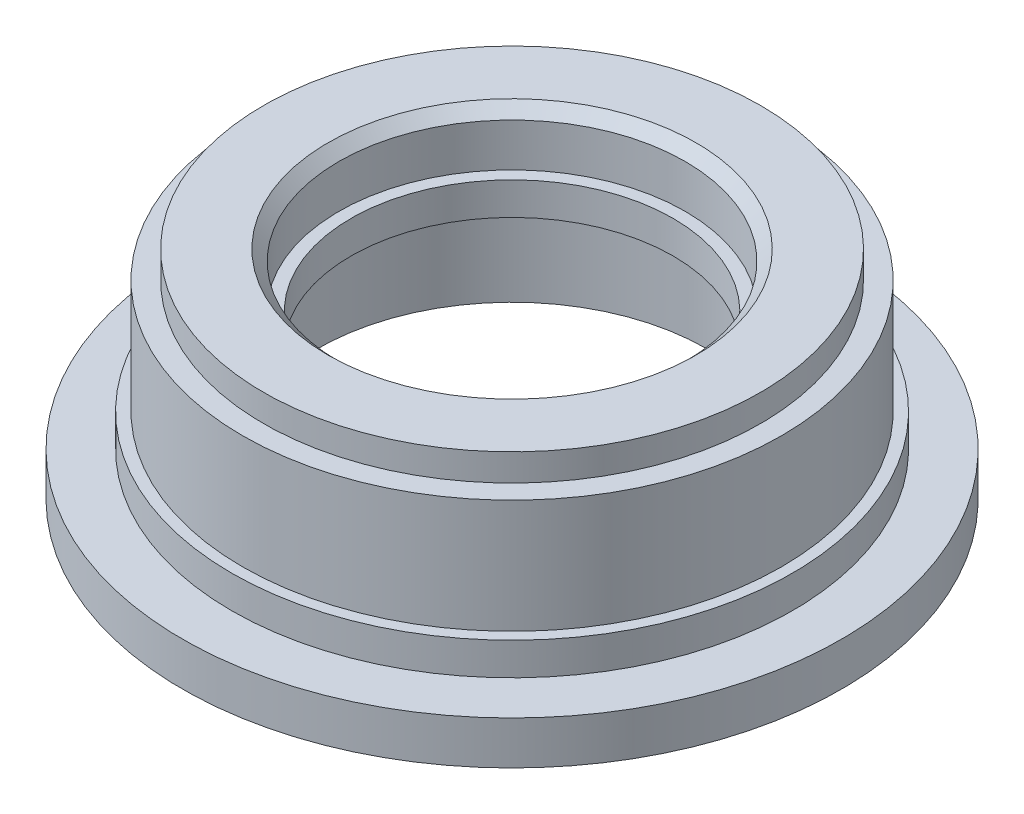
ISO-10303-21;
HEADER;
FILE_DESCRIPTION(('STEP AP214'),'2;1');
FILE_NAME('part.step','',(''),(''),'','','');
FILE_SCHEMA(('AUTOMOTIVE_DESIGN { 1 0 10303 214 1 1 1 1 }'));
ENDSEC;
DATA;
#1=APPLICATION_CONTEXT('core data for automotive mechanical design processes');
#2=APPLICATION_PROTOCOL_DEFINITION('international standard','automotive_design',2000,#1);
#3=PRODUCT_CONTEXT('',#1,'mechanical');
#4=PRODUCT('Part','Part','',(#3));
#5=PRODUCT_RELATED_PRODUCT_CATEGORY('part','',(#4));
#6=PRODUCT_DEFINITION_FORMATION('','',#4);
#7=PRODUCT_DEFINITION_CONTEXT('part definition',#1,'design');
#8=PRODUCT_DEFINITION('design','',#6,#7);
#9=PRODUCT_DEFINITION_SHAPE('','',#8);
#10=(LENGTH_UNIT() NAMED_UNIT(*) SI_UNIT(.MILLI.,.METRE.));
#11=(NAMED_UNIT(*) PLANE_ANGLE_UNIT() SI_UNIT($,.RADIAN.));
#12=(NAMED_UNIT(*) SI_UNIT($,.STERADIAN.) SOLID_ANGLE_UNIT());
#13=UNCERTAINTY_MEASURE_WITH_UNIT(LENGTH_MEASURE(1.E-05),#10,'distance_accuracy_value','');
#14=(GEOMETRIC_REPRESENTATION_CONTEXT(3) GLOBAL_UNCERTAINTY_ASSIGNED_CONTEXT((#13)) GLOBAL_UNIT_ASSIGNED_CONTEXT((#10,
#11,#12)) REPRESENTATION_CONTEXT('',''));
#15=CARTESIAN_POINT('',(0.,0.,0.));
#16=DIRECTION('',(0.,0.,1.));
#17=DIRECTION('',(1.,0.,0.));
#18=AXIS2_PLACEMENT_3D('',#15,#16,#17);
#19=CARTESIAN_POINT('',(0.,16.6624,0.));
#20=DIRECTION('',(0.,1.,0.));
#21=DIRECTION('',(0.,0.,1.));
#22=AXIS2_PLACEMENT_3D('',#19,#20,#21);
#23=CONICAL_SURFACE('',#22,13.49375,0.785398163397448);
#24=CARTESIAN_POINT('',(0.,15.86865,0.));
#25=DIRECTION('',(0.,-1.,0.));
#26=DIRECTION('',(0.,0.,-1.));
#27=AXIS2_PLACEMENT_3D('',#24,#25,#26);
#28=CIRCLE('',#27,12.7);
#29=CARTESIAN_POINT('',(0.,15.86865,-12.7));
#30=VERTEX_POINT('',#29);
#31=EDGE_CURVE('E30',#30,#30,#28,.T.);
#32=ORIENTED_EDGE('',*,*,#31,.T.);
#33=EDGE_LOOP('',(#32));
#34=FACE_BOUND('',#33,.T.);
#35=CARTESIAN_POINT('',(0.,16.6624,0.));
#36=DIRECTION('',(0.,1.,0.));
#37=DIRECTION('',(0.,0.,1.));
#38=AXIS2_PLACEMENT_3D('',#35,#36,#37);
#39=CIRCLE('',#38,13.49375);
#40=CARTESIAN_POINT('',(0.,16.6624,13.49375));
#41=VERTEX_POINT('',#40);
#42=EDGE_CURVE('E18',#41,#41,#39,.F.);
#43=ORIENTED_EDGE('',*,*,#42,.F.);
#44=EDGE_LOOP('',(#43));
#45=FACE_BOUND('',#44,.T.);
#46=ADVANCED_FACE('F15',(#34,#45),#23,.F.);
#47=CARTESIAN_POINT('',(0.,0.,0.));
#48=DIRECTION('',(0.,-1.,0.));
#49=DIRECTION('',(0.,0.,-1.));
#50=AXIS2_PLACEMENT_3D('',#47,#48,#49);
#51=CYLINDRICAL_SURFACE('',#50,12.7);
#52=CARTESIAN_POINT('',(0.,12.7,0.));
#53=DIRECTION('',(0.,-1.,0.));
#54=DIRECTION('',(0.,0.,-1.));
#55=AXIS2_PLACEMENT_3D('',#52,#53,#54);
#56=CIRCLE('',#55,12.7);
#57=CARTESIAN_POINT('',(0.,12.7,-12.7));
#58=VERTEX_POINT('',#57);
#59=EDGE_CURVE('E72',#58,#58,#56,.F.);
#60=ORIENTED_EDGE('',*,*,#59,.F.);
#61=EDGE_LOOP('',(#60));
#62=FACE_BOUND('',#61,.T.);
#63=ORIENTED_EDGE('',*,*,#31,.F.);
#64=EDGE_LOOP('',(#63));
#65=FACE_BOUND('',#64,.T.);
#66=ADVANCED_FACE('F84',(#62,#65),#51,.F.);
#67=CARTESIAN_POINT('',(13.49375,16.6624,0.));
#68=DIRECTION('',(0.,1.,0.));
#69=DIRECTION('',(0.,0.,1.));
#70=AXIS2_PLACEMENT_3D('',#67,#68,#69);
#71=PLANE('',#70);
#72=CARTESIAN_POINT('',(0.,16.6624,0.));
#73=DIRECTION('',(0.,-1.,0.));
#74=DIRECTION('',(0.,0.,-1.));
#75=AXIS2_PLACEMENT_3D('',#72,#73,#74);
#76=CIRCLE('',#75,18.2245);
#77=CARTESIAN_POINT('',(0.,16.6624,-18.2245));
#78=VERTEX_POINT('',#77);
#79=EDGE_CURVE('E70',#78,#78,#76,.T.);
#80=ORIENTED_EDGE('',*,*,#79,.F.);
#81=EDGE_LOOP('',(#80));
#82=FACE_BOUND('',#81,.T.);
#83=ORIENTED_EDGE('',*,*,#42,.T.);
#84=EDGE_LOOP('',(#83));
#85=FACE_BOUND('',#84,.T.);
#86=ADVANCED_FACE('F86',(#82,#85),#71,.T.);
#87=CARTESIAN_POINT('',(11.811,12.7,0.));
#88=DIRECTION('',(0.,1.,0.));
#89=DIRECTION('',(0.,0.,1.));
#90=AXIS2_PLACEMENT_3D('',#87,#88,#89);
#91=PLANE('',#90);
#92=ORIENTED_EDGE('',*,*,#59,.T.);
#93=EDGE_LOOP('',(#92));
#94=FACE_BOUND('',#93,.T.);
#95=CARTESIAN_POINT('',(0.,12.7,0.));
#96=DIRECTION('',(0.,-1.,0.));
#97=DIRECTION('',(0.,0.,-1.));
#98=AXIS2_PLACEMENT_3D('',#95,#96,#97);
#99=CIRCLE('',#98,11.811);
#100=CARTESIAN_POINT('',(0.,12.7,-11.811));
#101=VERTEX_POINT('',#100);
#102=EDGE_CURVE('E67',#101,#101,#99,.T.);
#103=ORIENTED_EDGE('',*,*,#102,.T.);
#104=EDGE_LOOP('',(#103));
#105=FACE_BOUND('',#104,.T.);
#106=ADVANCED_FACE('F93',(#94,#105),#91,.T.);
#107=CARTESIAN_POINT('',(0.,0.,0.));
#108=DIRECTION('',(0.,-1.,0.));
#109=DIRECTION('',(0.,0.,-1.));
#110=AXIS2_PLACEMENT_3D('',#107,#108,#109);
#111=CYLINDRICAL_SURFACE('',#110,18.2245);
#112=ORIENTED_EDGE('',*,*,#79,.T.);
#113=EDGE_LOOP('',(#112));
#114=FACE_BOUND('',#113,.T.);
#115=CARTESIAN_POINT('',(0.,14.678025,0.));
#116=DIRECTION('',(0.,-1.,0.));
#117=DIRECTION('',(0.,0.,-1.));
#118=AXIS2_PLACEMENT_3D('',#115,#116,#117);
#119=CIRCLE('',#118,18.2245);
#120=CARTESIAN_POINT('',(0.,14.678025,-18.2245));
#121=VERTEX_POINT('',#120);
#122=EDGE_CURVE('E64',#121,#121,#119,.T.);
#123=ORIENTED_EDGE('',*,*,#122,.F.);
#124=EDGE_LOOP('',(#123));
#125=FACE_BOUND('',#124,.T.);
#126=ADVANCED_FACE('F154',(#114,#125),#111,.T.);
#127=CARTESIAN_POINT('',(0.,0.,0.));
#128=DIRECTION('',(0.,-1.,0.));
#129=DIRECTION('',(0.,0.,-1.));
#130=AXIS2_PLACEMENT_3D('',#127,#128,#129);
#131=CYLINDRICAL_SURFACE('',#130,11.811);
#132=CARTESIAN_POINT('',(0.,10.3124,0.));
#133=DIRECTION('',(0.,-1.,0.));
#134=DIRECTION('',(0.,0.,-1.));
#135=AXIS2_PLACEMENT_3D('',#132,#133,#134);
#136=CIRCLE('',#135,11.811);
#137=CARTESIAN_POINT('',(0.,10.3124,-11.811));
#138=VERTEX_POINT('',#137);
#139=EDGE_CURVE('E61',#138,#138,#136,.F.);
#140=ORIENTED_EDGE('',*,*,#139,.F.);
#141=EDGE_LOOP('',(#140));
#142=FACE_BOUND('',#141,.T.);
#143=ORIENTED_EDGE('',*,*,#102,.F.);
#144=EDGE_LOOP('',(#143));
#145=FACE_BOUND('',#144,.T.);
#146=ADVANCED_FACE('F150',(#142,#145),#131,.F.);
#147=CARTESIAN_POINT('',(18.2245,14.678025,0.));
#148=DIRECTION('',(0.,1.,0.));
#149=DIRECTION('',(0.,0.,1.));
#150=AXIS2_PLACEMENT_3D('',#147,#148,#149);
#151=PLANE('',#150);
#152=CARTESIAN_POINT('',(0.,14.678025,0.));
#153=DIRECTION('',(0.,-1.,0.));
#154=DIRECTION('',(0.,0.,-1.));
#155=AXIS2_PLACEMENT_3D('',#152,#153,#154);
#156=CIRCLE('',#155,19.7612);
#157=CARTESIAN_POINT('',(0.,14.678025,-19.7612));
#158=VERTEX_POINT('',#157);
#159=EDGE_CURVE('E58',#158,#158,#156,.T.);
#160=ORIENTED_EDGE('',*,*,#159,.F.);
#161=EDGE_LOOP('',(#160));
#162=FACE_BOUND('',#161,.T.);
#163=ORIENTED_EDGE('',*,*,#122,.T.);
#164=EDGE_LOOP('',(#163));
#165=FACE_BOUND('',#164,.T.);
#166=ADVANCED_FACE('F146',(#162,#165),#151,.T.);
#167=CARTESIAN_POINT('',(14.2875,10.3124,0.));
#168=DIRECTION('',(0.,-1.,0.));
#169=DIRECTION('',(0.,0.,-1.));
#170=AXIS2_PLACEMENT_3D('',#167,#168,#169);
#171=PLANE('',#170);
#172=ORIENTED_EDGE('',*,*,#139,.T.);
#173=EDGE_LOOP('',(#172));
#174=FACE_BOUND('',#173,.T.);
#175=CARTESIAN_POINT('',(0.,10.3124,0.));
#176=DIRECTION('',(0.,-1.,0.));
#177=DIRECTION('',(0.,0.,-1.));
#178=AXIS2_PLACEMENT_3D('',#175,#176,#177);
#179=CIRCLE('',#178,14.2875);
#180=CARTESIAN_POINT('',(0.,10.3124,-14.2875));
#181=VERTEX_POINT('',#180);
#182=EDGE_CURVE('E55',#181,#181,#179,.T.);
#183=ORIENTED_EDGE('',*,*,#182,.T.);
#184=EDGE_LOOP('',(#183));
#185=FACE_BOUND('',#184,.T.);
#186=ADVANCED_FACE('F142',(#174,#185),#171,.T.);
#187=CARTESIAN_POINT('',(0.,0.,0.));
#188=DIRECTION('',(0.,-1.,0.));
#189=DIRECTION('',(0.,0.,-1.));
#190=AXIS2_PLACEMENT_3D('',#187,#188,#189);
#191=CYLINDRICAL_SURFACE('',#190,19.7612);
#192=ORIENTED_EDGE('',*,*,#159,.T.);
#193=EDGE_LOOP('',(#192));
#194=FACE_BOUND('',#193,.T.);
#195=CARTESIAN_POINT('',(0.,6.35,0.));
#196=DIRECTION('',(0.,-1.,0.));
#197=DIRECTION('',(0.,0.,-1.));
#198=AXIS2_PLACEMENT_3D('',#195,#196,#197);
#199=CIRCLE('',#198,19.7612);
#200=CARTESIAN_POINT('',(0.,6.35,-19.7612));
#201=VERTEX_POINT('',#200);
#202=EDGE_CURVE('E52',#201,#201,#199,.T.);
#203=ORIENTED_EDGE('',*,*,#202,.F.);
#204=EDGE_LOOP('',(#203));
#205=FACE_BOUND('',#204,.T.);
#206=ADVANCED_FACE('F138',(#194,#205),#191,.T.);
#207=CARTESIAN_POINT('',(0.,0.,0.));
#208=DIRECTION('',(0.,-1.,0.));
#209=DIRECTION('',(0.,0.,-1.));
#210=AXIS2_PLACEMENT_3D('',#207,#208,#209);
#211=CYLINDRICAL_SURFACE('',#210,14.2875);
#212=CARTESIAN_POINT('',(0.,3.175,0.));
#213=DIRECTION('',(0.,-1.,0.));
#214=DIRECTION('',(0.,0.,-1.));
#215=AXIS2_PLACEMENT_3D('',#212,#213,#214);
#216=CIRCLE('',#215,14.2875);
#217=CARTESIAN_POINT('',(0.,3.175,-14.2875));
#218=VERTEX_POINT('',#217);
#219=EDGE_CURVE('E49',#218,#218,#216,.F.);
#220=ORIENTED_EDGE('',*,*,#219,.F.);
#221=EDGE_LOOP('',(#220));
#222=FACE_BOUND('',#221,.T.);
#223=ORIENTED_EDGE('',*,*,#182,.F.);
#224=EDGE_LOOP('',(#223));
#225=FACE_BOUND('',#224,.T.);
#226=ADVANCED_FACE('F134',(#222,#225),#211,.F.);
#227=CARTESIAN_POINT('',(19.7612,6.35,0.));
#228=DIRECTION('',(0.,1.,0.));
#229=DIRECTION('',(0.,0.,1.));
#230=AXIS2_PLACEMENT_3D('',#227,#228,#229);
#231=PLANE('',#230);
#232=CARTESIAN_POINT('',(0.,6.35,0.));
#233=DIRECTION('',(0.,-1.,0.));
#234=DIRECTION('',(0.,0.,-1.));
#235=AXIS2_PLACEMENT_3D('',#232,#233,#234);
#236=CIRCLE('',#235,20.5613);
#237=CARTESIAN_POINT('',(0.,6.35,-20.5613));
#238=VERTEX_POINT('',#237);
#239=EDGE_CURVE('E46',#238,#238,#236,.T.);
#240=ORIENTED_EDGE('',*,*,#239,.F.);
#241=EDGE_LOOP('',(#240));
#242=FACE_BOUND('',#241,.T.);
#243=ORIENTED_EDGE('',*,*,#202,.T.);
#244=EDGE_LOOP('',(#243));
#245=FACE_BOUND('',#244,.T.);
#246=ADVANCED_FACE('F130',(#242,#245),#231,.T.);
#247=CARTESIAN_POINT('',(17.0561,3.175,0.));
#248=DIRECTION('',(0.,-1.,0.));
#249=DIRECTION('',(0.,0.,-1.));
#250=AXIS2_PLACEMENT_3D('',#247,#248,#249);
#251=PLANE('',#250);
#252=ORIENTED_EDGE('',*,*,#219,.T.);
#253=EDGE_LOOP('',(#252));
#254=FACE_BOUND('',#253,.T.);
#255=CARTESIAN_POINT('',(0.,3.175,0.));
#256=DIRECTION('',(0.,-1.,0.));
#257=DIRECTION('',(0.,0.,-1.));
#258=AXIS2_PLACEMENT_3D('',#255,#256,#257);
#259=CIRCLE('',#258,17.0561);
#260=CARTESIAN_POINT('',(0.,3.175,-17.0561));
#261=VERTEX_POINT('',#260);
#262=EDGE_CURVE('E43',#261,#261,#259,.T.);
#263=ORIENTED_EDGE('',*,*,#262,.T.);
#264=EDGE_LOOP('',(#263));
#265=FACE_BOUND('',#264,.T.);
#266=ADVANCED_FACE('F126',(#254,#265),#251,.T.);
#267=CARTESIAN_POINT('',(0.,0.,0.));
#268=DIRECTION('',(0.,-1.,0.));
#269=DIRECTION('',(0.,0.,-1.));
#270=AXIS2_PLACEMENT_3D('',#267,#268,#269);
#271=CYLINDRICAL_SURFACE('',#270,20.5613);
#272=ORIENTED_EDGE('',*,*,#239,.T.);
#273=EDGE_LOOP('',(#272));
#274=FACE_BOUND('',#273,.T.);
#275=CARTESIAN_POINT('',(0.,3.9624,0.));
#276=DIRECTION('',(0.,-1.,0.));
#277=DIRECTION('',(0.,0.,-1.));
#278=AXIS2_PLACEMENT_3D('',#275,#276,#277);
#279=CIRCLE('',#278,20.5613);
#280=CARTESIAN_POINT('',(0.,3.9624,-20.5613));
#281=VERTEX_POINT('',#280);
#282=EDGE_CURVE('E40',#281,#281,#279,.T.);
#283=ORIENTED_EDGE('',*,*,#282,.F.);
#284=EDGE_LOOP('',(#283));
#285=FACE_BOUND('',#284,.T.);
#286=ADVANCED_FACE('F122',(#274,#285),#271,.T.);
#287=CARTESIAN_POINT('',(0.,0.,0.));
#288=DIRECTION('',(0.,-1.,0.));
#289=DIRECTION('',(0.,0.,-1.));
#290=AXIS2_PLACEMENT_3D('',#287,#288,#289);
#291=CYLINDRICAL_SURFACE('',#290,17.0561);
#292=CARTESIAN_POINT('',(0.,1.2954,0.));
#293=DIRECTION('',(0.,-1.,0.));
#294=DIRECTION('',(0.,0.,-1.));
#295=AXIS2_PLACEMENT_3D('',#292,#293,#294);
#296=CIRCLE('',#295,17.0561);
#297=CARTESIAN_POINT('',(0.,1.2954,-17.0561));
#298=VERTEX_POINT('',#297);
#299=EDGE_CURVE('E37',#298,#298,#296,.F.);
#300=ORIENTED_EDGE('',*,*,#299,.F.);
#301=EDGE_LOOP('',(#300));
#302=FACE_BOUND('',#301,.T.);
#303=ORIENTED_EDGE('',*,*,#262,.F.);
#304=EDGE_LOOP('',(#303));
#305=FACE_BOUND('',#304,.T.);
#306=ADVANCED_FACE('F118',(#302,#305),#291,.F.);
#307=CARTESIAN_POINT('',(20.5613,3.9624,0.));
#308=DIRECTION('',(0.,1.,0.));
#309=DIRECTION('',(0.,0.,1.));
#310=AXIS2_PLACEMENT_3D('',#307,#308,#309);
#311=PLANE('',#310);
#312=CARTESIAN_POINT('',(0.,3.9624,0.));
#313=DIRECTION('',(0.,-1.,0.));
#314=DIRECTION('',(0.,0.,-1.));
#315=AXIS2_PLACEMENT_3D('',#312,#313,#314);
#316=CIRCLE('',#315,24.1681);
#317=CARTESIAN_POINT('',(0.,3.9624,-24.1681));
#318=VERTEX_POINT('',#317);
#319=EDGE_CURVE('E34',#318,#318,#316,.T.);
#320=ORIENTED_EDGE('',*,*,#319,.F.);
#321=EDGE_LOOP('',(#320));
#322=FACE_BOUND('',#321,.T.);
#323=ORIENTED_EDGE('',*,*,#282,.T.);
#324=EDGE_LOOP('',(#323));
#325=FACE_BOUND('',#324,.T.);
#326=ADVANCED_FACE('F114',(#322,#325),#311,.T.);
#327=CARTESIAN_POINT('',(18.542,1.2954,0.));
#328=DIRECTION('',(0.,-1.,0.));
#329=DIRECTION('',(0.,0.,-1.));
#330=AXIS2_PLACEMENT_3D('',#327,#328,#329);
#331=PLANE('',#330);
#332=ORIENTED_EDGE('',*,*,#299,.T.);
#333=EDGE_LOOP('',(#332));
#334=FACE_BOUND('',#333,.T.);
#335=CARTESIAN_POINT('',(0.,1.2954,0.));
#336=DIRECTION('',(0.,-1.,0.));
#337=DIRECTION('',(0.,0.,-1.));
#338=AXIS2_PLACEMENT_3D('',#335,#336,#337);
#339=CIRCLE('',#338,18.542);
#340=CARTESIAN_POINT('',(0.,1.2954,-18.542));
#341=VERTEX_POINT('',#340);
#342=EDGE_CURVE('E27',#341,#341,#339,.T.);
#343=ORIENTED_EDGE('',*,*,#342,.T.);
#344=EDGE_LOOP('',(#343));
#345=FACE_BOUND('',#344,.T.);
#346=ADVANCED_FACE('F110',(#334,#345),#331,.T.);
#347=CARTESIAN_POINT('',(0.,0.,0.));
#348=DIRECTION('',(0.,-1.,0.));
#349=DIRECTION('',(0.,0.,-1.));
#350=AXIS2_PLACEMENT_3D('',#347,#348,#349);
#351=CYLINDRICAL_SURFACE('',#350,24.1681);
#352=ORIENTED_EDGE('',*,*,#319,.T.);
#353=EDGE_LOOP('',(#352));
#354=FACE_BOUND('',#353,.T.);
#355=CARTESIAN_POINT('',(0.,0.787399999999997,0.));
#356=DIRECTION('',(0.,-1.,0.));
#357=DIRECTION('',(0.,0.,-1.));
#358=AXIS2_PLACEMENT_3D('',#355,#356,#357);
#359=CIRCLE('',#358,24.1681);
#360=CARTESIAN_POINT('',(0.,0.787399999999997,-24.1681));
#361=VERTEX_POINT('',#360);
#362=EDGE_CURVE('E22',#361,#361,#359,.T.);
#363=ORIENTED_EDGE('',*,*,#362,.F.);
#364=EDGE_LOOP('',(#363));
#365=FACE_BOUND('',#364,.T.);
#366=ADVANCED_FACE('F103',(#354,#365),#351,.T.);
#367=CARTESIAN_POINT('',(0.,0.,0.));
#368=DIRECTION('',(0.,-1.,0.));
#369=DIRECTION('',(0.,0.,-1.));
#370=AXIS2_PLACEMENT_3D('',#367,#368,#369);
#371=CYLINDRICAL_SURFACE('',#370,18.542);
#372=CARTESIAN_POINT('',(0.,0.787399999999996,0.));
#373=DIRECTION('',(0.,-1.,0.));
#374=DIRECTION('',(0.,0.,-1.));
#375=AXIS2_PLACEMENT_3D('',#372,#373,#374);
#376=CIRCLE('',#375,18.542);
#377=CARTESIAN_POINT('',(0.,0.787399999999996,-18.542));
#378=VERTEX_POINT('',#377);
#379=EDGE_CURVE('E10',#378,#378,#376,.F.);
#380=ORIENTED_EDGE('',*,*,#379,.F.);
#381=EDGE_LOOP('',(#380));
#382=FACE_BOUND('',#381,.T.);
#383=ORIENTED_EDGE('',*,*,#342,.F.);
#384=EDGE_LOOP('',(#383));
#385=FACE_BOUND('',#384,.T.);
#386=ADVANCED_FACE('F98',(#382,#385),#371,.F.);
#387=CARTESIAN_POINT('',(24.1681,0.787399999999997,0.));
#388=DIRECTION('',(0.,-1.,0.));
#389=DIRECTION('',(0.,0.,-1.));
#390=AXIS2_PLACEMENT_3D('',#387,#388,#389);
#391=PLANE('',#390);
#392=ORIENTED_EDGE('',*,*,#379,.T.);
#393=EDGE_LOOP('',(#392));
#394=FACE_BOUND('',#393,.T.);
#395=ORIENTED_EDGE('',*,*,#362,.T.);
#396=EDGE_LOOP('',(#395));
#397=FACE_BOUND('',#396,.T.);
#398=ADVANCED_FACE('F96',(#394,#397),#391,.T.);
#399=CLOSED_SHELL('',(#46,#66,#86,#106,#126,#146,#166,#186,#206,#226,#246,#266,#286,#306,#326,
#346,#366,#386,#398));
#400=MANIFOLD_SOLID_BREP('B1',#399);
#401=ADVANCED_BREP_SHAPE_REPRESENTATION('',(#18,#400),#14);
#402=SHAPE_DEFINITION_REPRESENTATION(#9,#401);
ENDSEC;
END-ISO-10303-21;
